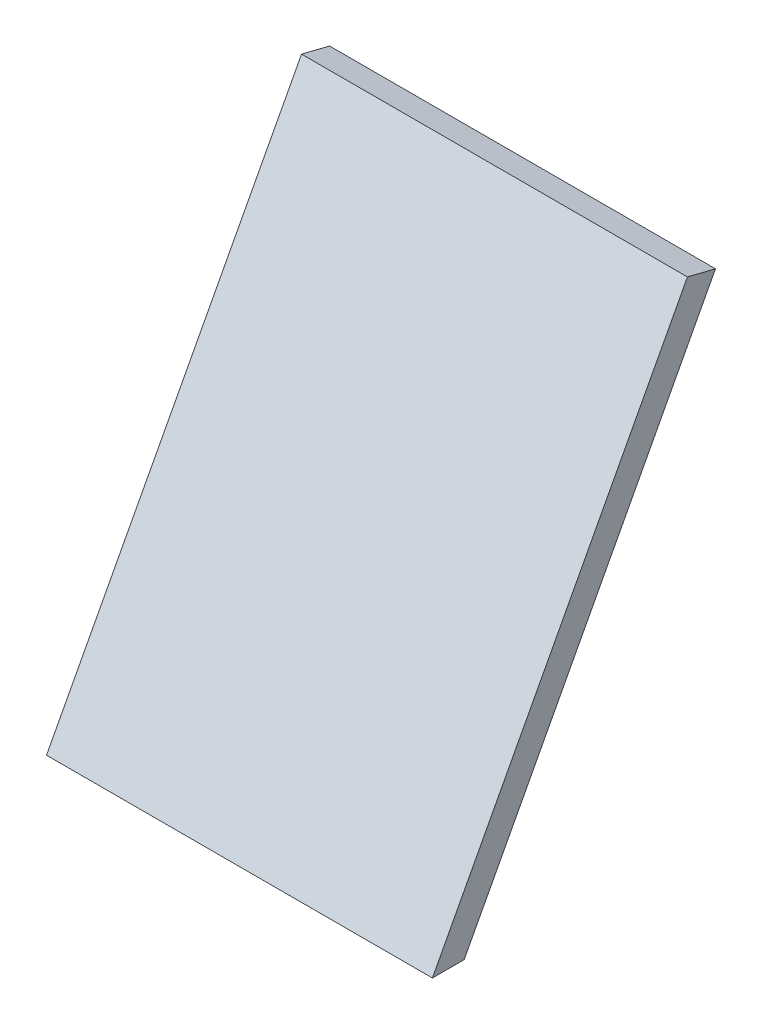
ISO-10303-21;
HEADER;
FILE_DESCRIPTION(('STEP AP214'),'2;1');
FILE_NAME('part.step','',(''),(''),'','','');
FILE_SCHEMA(('AUTOMOTIVE_DESIGN { 1 0 10303 214 1 1 1 1 }'));
ENDSEC;
DATA;
#1=APPLICATION_CONTEXT('core data for automotive mechanical design processes');
#2=APPLICATION_PROTOCOL_DEFINITION('international standard','automotive_design',2000,#1);
#3=PRODUCT_CONTEXT('',#1,'mechanical');
#4=PRODUCT('Part','Part','',(#3));
#5=PRODUCT_RELATED_PRODUCT_CATEGORY('part','',(#4));
#6=PRODUCT_DEFINITION_FORMATION('','',#4);
#7=PRODUCT_DEFINITION_CONTEXT('part definition',#1,'design');
#8=PRODUCT_DEFINITION('design','',#6,#7);
#9=PRODUCT_DEFINITION_SHAPE('','',#8);
#10=(LENGTH_UNIT() NAMED_UNIT(*) SI_UNIT(.MILLI.,.METRE.));
#11=(NAMED_UNIT(*) PLANE_ANGLE_UNIT() SI_UNIT($,.RADIAN.));
#12=(NAMED_UNIT(*) SI_UNIT($,.STERADIAN.) SOLID_ANGLE_UNIT());
#13=UNCERTAINTY_MEASURE_WITH_UNIT(LENGTH_MEASURE(1.E-05),#10,'distance_accuracy_value','');
#14=(GEOMETRIC_REPRESENTATION_CONTEXT(3) GLOBAL_UNCERTAINTY_ASSIGNED_CONTEXT((#13)) GLOBAL_UNIT_ASSIGNED_CONTEXT((#10,
#11,#12)) REPRESENTATION_CONTEXT('',''));
#15=CARTESIAN_POINT('',(0.,0.,0.));
#16=DIRECTION('',(0.,0.,1.));
#17=DIRECTION('',(1.,0.,0.));
#18=AXIS2_PLACEMENT_3D('',#15,#16,#17);
#19=CARTESIAN_POINT('',(-43.66,106.923746647894,-143.154202423773));
#20=DIRECTION('',(0.,0.970295726275996,-0.24192189559967));
#21=DIRECTION('',(0.,0.24192189559967,0.970295726275996));
#22=AXIS2_PLACEMENT_3D('',#19,#20,#21);
#23=PLANE('',#22);
#24=DIRECTION('',(0.,-0.24192189559967,-0.970295726275996));
#25=VECTOR('',#24,1.);
#26=CARTESIAN_POINT('',(-43.65,94.3012173907014,-193.780402101521));
#27=LINE('',#26,#25);
#28=CARTESIAN_POINT('',(-43.65,108.506979465948,-136.804202423773));
#29=VERTEX_POINT('',#28);
#30=CARTESIAN_POINT('',(-43.65,106.923746647894,-143.154202423773));
#31=VERTEX_POINT('',#30);
#32=EDGE_CURVE('E93',#29,#31,#27,.T.);
#33=ORIENTED_EDGE('',*,*,#32,.F.);
#34=DIRECTION('',(-1.,0.,0.));
#35=VECTOR('',#34,1.);
#36=CARTESIAN_POINT('',(50.,108.506979465948,-136.804202423773));
#37=LINE('',#36,#35);
#38=CARTESIAN_POINT('',(43.65,108.506979465948,-136.804202423773));
#39=VERTEX_POINT('',#38);
#40=EDGE_CURVE('E61',#39,#29,#37,.T.);
#41=ORIENTED_EDGE('',*,*,#40,.F.);
#42=DIRECTION('',(0.,0.24192189559967,0.970295726275996));
#43=VECTOR('',#42,1.);
#44=CARTESIAN_POINT('',(43.65,94.3012173907014,-193.780402101521));
#45=LINE('',#44,#43);
#46=CARTESIAN_POINT('',(43.65,106.923746647894,-143.154202423773));
#47=VERTEX_POINT('',#46);
#48=EDGE_CURVE('E85',#47,#39,#45,.T.);
#49=ORIENTED_EDGE('',*,*,#48,.F.);
#50=DIRECTION('',(-1.,0.,0.));
#51=VECTOR('',#50,1.);
#52=CARTESIAN_POINT('',(50.,106.923746647894,-143.154202423773));
#53=LINE('',#52,#51);
#54=EDGE_CURVE('E40',#47,#31,#53,.T.);
#55=ORIENTED_EDGE('',*,*,#54,.T.);
#56=EDGE_LOOP('',(#33,#41,#49,#55));
#57=FACE_BOUND('',#56,.T.);
#58=ADVANCED_FACE('F36',(#57),#23,.T.);
#59=CARTESIAN_POINT('',(43.65,-0.00999999999995449,-170.265974623788));
#60=DIRECTION('',(1.,0.,0.));
#61=DIRECTION('',(0.,0.,-1.));
#62=AXIS2_PLACEMENT_3D('',#59,#60,#61);
#63=PLANE('',#62);
#64=DIRECTION('',(0.,0.882947592858925,-0.469471562785895));
#65=VECTOR('',#64,1.);
#66=CARTESIAN_POINT('',(43.65,106.923746647894,-143.154202423773));
#67=LINE('',#66,#65);
#68=CARTESIAN_POINT('',(43.65,0.,-86.3018378625049));
#69=VERTEX_POINT('',#68);
#70=EDGE_CURVE('E45',#69,#47,#67,.T.);
#71=ORIENTED_EDGE('',*,*,#70,.T.);
#72=ORIENTED_EDGE('',*,*,#48,.T.);
#73=DIRECTION('',(0.,0.882947592858925,-0.469471562785895));
#74=VECTOR('',#73,1.);
#75=CARTESIAN_POINT('',(43.65,-32.7925886605947,-61.6738893611958));
#76=LINE('',#75,#74);
#77=CARTESIAN_POINT('',(43.65,0.,-79.1100180406295));
#78=VERTEX_POINT('',#77);
#79=EDGE_CURVE('E101',#78,#39,#76,.T.);
#80=ORIENTED_EDGE('',*,*,#79,.F.);
#81=DIRECTION('',(0.,0.,1.));
#82=VECTOR('',#81,1.);
#83=CARTESIAN_POINT('',(43.65,0.,-143.164202423773));
#84=LINE('',#83,#82);
#85=EDGE_CURVE('E86',#69,#78,#84,.T.);
#86=ORIENTED_EDGE('',*,*,#85,.F.);
#87=EDGE_LOOP('',(#71,#72,#80,#86));
#88=FACE_BOUND('',#87,.T.);
#89=ADVANCED_FACE('F84',(#88),#63,.T.);
#90=CARTESIAN_POINT('',(-62.575,0.,-143.164202423773));
#91=DIRECTION('',(0.,-1.,0.));
#92=DIRECTION('',(1.,0.,0.));
#93=AXIS2_PLACEMENT_3D('',#90,#91,#92);
#94=PLANE('',#93);
#95=DIRECTION('',(-1.,0.,0.));
#96=VECTOR('',#95,1.);
#97=CARTESIAN_POINT('',(50.,0.,-79.1100180406295));
#98=LINE('',#97,#96);
#99=CARTESIAN_POINT('',(-43.65,0.,-79.1100180406295));
#100=VERTEX_POINT('',#99);
#101=EDGE_CURVE('E53',#78,#100,#98,.T.);
#102=ORIENTED_EDGE('',*,*,#101,.T.);
#103=DIRECTION('',(0.,0.,-1.));
#104=VECTOR('',#103,1.);
#105=CARTESIAN_POINT('',(-43.65,0.,-143.164202423773));
#106=LINE('',#105,#104);
#107=CARTESIAN_POINT('',(-43.65,0.,-86.3018378625049));
#108=VERTEX_POINT('',#107);
#109=EDGE_CURVE('E99',#100,#108,#106,.T.);
#110=ORIENTED_EDGE('',*,*,#109,.T.);
#111=DIRECTION('',(-1.,0.,0.));
#112=VECTOR('',#111,1.);
#113=CARTESIAN_POINT('',(50.,0.,-86.3018378625049));
#114=LINE('',#113,#112);
#115=EDGE_CURVE('E97',#69,#108,#114,.T.);
#116=ORIENTED_EDGE('',*,*,#115,.F.);
#117=ORIENTED_EDGE('',*,*,#85,.T.);
#118=EDGE_LOOP('',(#102,#110,#116,#117));
#119=FACE_BOUND('',#118,.T.);
#120=ADVANCED_FACE('F109',(#119),#94,.T.);
#121=CARTESIAN_POINT('',(-43.65,-0.00999999999995449,-170.265974623788));
#122=DIRECTION('',(-1.,0.,0.));
#123=DIRECTION('',(0.,0.,1.));
#124=AXIS2_PLACEMENT_3D('',#121,#122,#123);
#125=PLANE('',#124);
#126=DIRECTION('',(0.,0.882947592858925,-0.469471562785895));
#127=VECTOR('',#126,1.);
#128=CARTESIAN_POINT('',(-43.65,-32.7925886605947,-61.6738893611958));
#129=LINE('',#128,#127);
#130=EDGE_CURVE('E11',#100,#29,#129,.T.);
#131=ORIENTED_EDGE('',*,*,#130,.T.);
#132=ORIENTED_EDGE('',*,*,#32,.T.);
#133=DIRECTION('',(0.,-0.882947592858925,0.469471562785895));
#134=VECTOR('',#133,1.);
#135=CARTESIAN_POINT('',(-43.65,106.923746647894,-143.154202423773));
#136=LINE('',#135,#134);
#137=EDGE_CURVE('E89',#31,#108,#136,.T.);
#138=ORIENTED_EDGE('',*,*,#137,.T.);
#139=ORIENTED_EDGE('',*,*,#109,.F.);
#140=EDGE_LOOP('',(#131,#132,#138,#139));
#141=FACE_BOUND('',#140,.T.);
#142=ADVANCED_FACE('F38',(#141),#125,.T.);
#143=CARTESIAN_POINT('',(50.,109.904891071585,-137.547485209119));
#144=DIRECTION('',(0.,0.469471562785895,0.882947592858925));
#145=DIRECTION('',(0.,-0.882947592858925,0.469471562785895));
#146=AXIS2_PLACEMENT_3D('',#143,#144,#145);
#147=PLANE('',#146);
#148=ORIENTED_EDGE('',*,*,#130,.F.);
#149=ORIENTED_EDGE('',*,*,#101,.F.);
#150=ORIENTED_EDGE('',*,*,#79,.T.);
#151=ORIENTED_EDGE('',*,*,#40,.T.);
#152=EDGE_LOOP('',(#148,#149,#150,#151));
#153=FACE_BOUND('',#152,.T.);
#154=ADVANCED_FACE('F110',(#153),#147,.T.);
#155=CARTESIAN_POINT('',(50.,106.923746647894,-143.154202423773));
#156=DIRECTION('',(0.,0.469471562785895,0.882947592858925));
#157=DIRECTION('',(0.,-0.882947592858925,0.469471562785895));
#158=AXIS2_PLACEMENT_3D('',#155,#156,#157);
#159=PLANE('',#158);
#160=ORIENTED_EDGE('',*,*,#137,.F.);
#161=ORIENTED_EDGE('',*,*,#54,.F.);
#162=ORIENTED_EDGE('',*,*,#70,.F.);
#163=ORIENTED_EDGE('',*,*,#115,.T.);
#164=EDGE_LOOP('',(#160,#161,#162,#163));
#165=FACE_BOUND('',#164,.T.);
#166=ADVANCED_FACE('F94',(#165),#159,.F.);
#167=CLOSED_SHELL('',(#58,#89,#120,#142,#154,#166));
#168=MANIFOLD_SOLID_BREP('B2',#167);
#169=ADVANCED_BREP_SHAPE_REPRESENTATION('',(#18,#168),#14);
#170=SHAPE_DEFINITION_REPRESENTATION(#9,#169);
ENDSEC;
END-ISO-10303-21;
